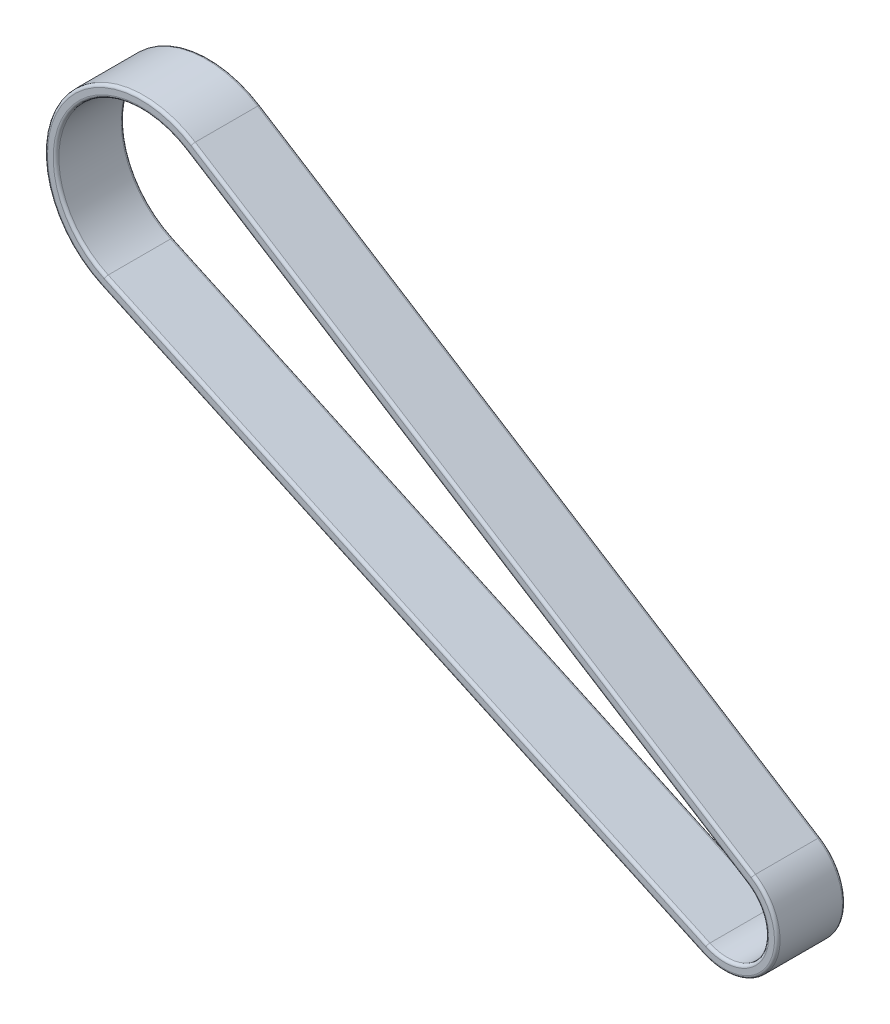
ISO-10303-21;
HEADER;
FILE_DESCRIPTION(('STEP AP214'),'2;1');
FILE_NAME('part.step','',(''),(''),'','','');
FILE_SCHEMA(('AUTOMOTIVE_DESIGN { 1 0 10303 214 1 1 1 1 }'));
ENDSEC;
DATA;
#1=APPLICATION_CONTEXT('core data for automotive mechanical design processes');
#2=APPLICATION_PROTOCOL_DEFINITION('international standard','automotive_design',2000,#1);
#3=PRODUCT_CONTEXT('',#1,'mechanical');
#4=PRODUCT('Part','Part','',(#3));
#5=PRODUCT_RELATED_PRODUCT_CATEGORY('part','',(#4));
#6=PRODUCT_DEFINITION_FORMATION('','',#4);
#7=PRODUCT_DEFINITION_CONTEXT('part definition',#1,'design');
#8=PRODUCT_DEFINITION('design','',#6,#7);
#9=PRODUCT_DEFINITION_SHAPE('','',#8);
#10=(LENGTH_UNIT() NAMED_UNIT(*) SI_UNIT(.MILLI.,.METRE.));
#11=(NAMED_UNIT(*) PLANE_ANGLE_UNIT() SI_UNIT($,.RADIAN.));
#12=(NAMED_UNIT(*) SI_UNIT($,.STERADIAN.) SOLID_ANGLE_UNIT());
#13=UNCERTAINTY_MEASURE_WITH_UNIT(LENGTH_MEASURE(1.E-05),#10,'distance_accuracy_value','');
#14=(GEOMETRIC_REPRESENTATION_CONTEXT(3) GLOBAL_UNCERTAINTY_ASSIGNED_CONTEXT((#13)) GLOBAL_UNIT_ASSIGNED_CONTEXT((#10,
#11,#12)) REPRESENTATION_CONTEXT('',''));
#15=CARTESIAN_POINT('',(0.,0.,0.));
#16=DIRECTION('',(0.,0.,1.));
#17=DIRECTION('',(1.,0.,0.));
#18=AXIS2_PLACEMENT_3D('',#15,#16,#17);
#19=CARTESIAN_POINT('',(-3.06760585061165,-6.64608858526256,-5.));
#20=DIRECTION('',(0.,0.,-1.));
#21=DIRECTION('',(-0.907950009688735,0.419078488956694,0.));
#22=AXIS2_PLACEMENT_3D('',#19,#20,#21);
#23=PLANE('',#22);
#24=CARTESIAN_POINT('',(1.38777878078145E-13,0.,-5.));
#25=DIRECTION('',(0.,0.,-1.));
#26=DIRECTION('',(-1.,0.,0.));
#27=AXIS2_PLACEMENT_3D('',#24,#25,#26);
#28=CIRCLE('',#27,8.81988381997051);
#29=CARTESIAN_POINT('',(4.71142714031744,7.4560582682313,-5.));
#30=VERTEX_POINT('',#29);
#31=CARTESIAN_POINT('',(-3.6962235840467,-8.00801359979566,-5.));
#32=VERTEX_POINT('',#31);
#33=EDGE_CURVE('E192',#30,#32,#28,.T.);
#34=ORIENTED_EDGE('',*,*,#33,.T.);
#35=DIRECTION('',(-0.907950009688735,0.419078488956694,0.));
#36=VECTOR('',#35,1.);
#37=CARTESIAN_POINT('',(-109.914795067786,41.0188248401359,-5.));
#38=LINE('',#37,#36);
#39=CARTESIAN_POINT('',(-109.914795067786,41.0188248401359,-5.));
#40=VERTEX_POINT('',#39);
#41=EDGE_CURVE('E194',#32,#40,#38,.T.);
#42=ORIENTED_EDGE('',*,*,#41,.T.);
#43=CARTESIAN_POINT('',(-103.,56.,-5.));
#44=DIRECTION('',(0.,0.,-1.));
#45=DIRECTION('',(-1.,0.,0.));
#46=AXIS2_PLACEMENT_3D('',#43,#44,#45);
#47=CIRCLE('',#46,16.5);
#48=CARTESIAN_POINT('',(-94.1859895887503,69.9485920605048,-5.));
#49=VERTEX_POINT('',#48);
#50=EDGE_CURVE('E188',#40,#49,#47,.T.);
#51=ORIENTED_EDGE('',*,*,#50,.T.);
#52=DIRECTION('',(0.845369215788168,-0.534182449166666,0.));
#53=VECTOR('',#52,1.);
#54=CARTESIAN_POINT('',(4.71142714031744,7.4560582682313,-5.));
#55=LINE('',#54,#53);
#56=EDGE_CURVE('E190',#49,#30,#55,.T.);
#57=ORIENTED_EDGE('',*,*,#56,.T.);
#58=EDGE_LOOP('',(#34,#42,#51,#57));
#59=FACE_BOUND('',#58,.T.);
#60=DIRECTION('',(0.845369215788168,-0.534182449166666,0.));
#61=VECTOR('',#60,1.);
#62=CARTESIAN_POINT('',(4.98623287259965,6.09949550524219,-5.));
#63=LINE('',#62,#61);
#64=CARTESIAN_POINT('',(4.17724469115077,6.61068905244314,-5.));
#65=VERTEX_POINT('',#64);
#66=CARTESIAN_POINT('',(-94.720172037917,69.1032228447166,-5.));
#67=VERTEX_POINT('',#66);
#68=EDGE_CURVE('E155',#65,#67,#63,.F.);
#69=ORIENTED_EDGE('',*,*,#68,.T.);
#70=CARTESIAN_POINT('',(-103.,56.,-5.));
#71=DIRECTION('',(0.,0.,-1.));
#72=DIRECTION('',(-1.,0.,0.));
#73=AXIS2_PLACEMENT_3D('',#70,#71,#72);
#74=CIRCLE('',#73,15.5);
#75=CARTESIAN_POINT('',(-109.495716578829,41.9267748498246,-5.));
#76=VERTEX_POINT('',#75);
#77=EDGE_CURVE('E186',#67,#76,#74,.F.);
#78=ORIENTED_EDGE('',*,*,#77,.T.);
#79=DIRECTION('',(-0.907950009688735,0.419078488956694,0.));
#80=VECTOR('',#79,1.);
#81=CARTESIAN_POINT('',(-3.27714509509,-7.10006359010692,-5.));
#82=LINE('',#81,#80);
#83=CARTESIAN_POINT('',(-3.27714509509,-7.10006359010692,-5.));
#84=VERTEX_POINT('',#83);
#85=EDGE_CURVE('E158',#76,#84,#82,.F.);
#86=ORIENTED_EDGE('',*,*,#85,.T.);
#87=CARTESIAN_POINT('',(1.38777878078145E-13,0.,-5.));
#88=DIRECTION('',(0.,0.,-1.));
#89=DIRECTION('',(-1.,0.,0.));
#90=AXIS2_PLACEMENT_3D('',#87,#88,#89);
#91=CIRCLE('',#90,7.81988381997051);
#92=EDGE_CURVE('E151',#84,#65,#91,.F.);
#93=ORIENTED_EDGE('',*,*,#92,.T.);
#94=EDGE_LOOP('',(#69,#78,#86,#93));
#95=FACE_BOUND('',#94,.T.);
#96=ADVANCED_FACE('F39',(#59,#95),#23,.T.);
#97=CARTESIAN_POINT('',(-94.9872632625003,68.6805382368225,7.));
#98=DIRECTION('',(0.,0.,-1.));
#99=DIRECTION('',(0.845369215788168,-0.534182449166666,0.));
#100=AXIS2_PLACEMENT_3D('',#97,#98,#99);
#101=PLANE('',#100);
#102=DIRECTION('',(-0.907950009688735,0.419078488956694,0.));
#103=VECTOR('',#102,1.);
#104=CARTESIAN_POINT('',(-3.69622358404669,-8.00801359979566,7.));
#105=LINE('',#104,#103);
#106=CARTESIAN_POINT('',(-109.914795067786,41.0188248401359,7.));
#107=VERTEX_POINT('',#106);
#108=CARTESIAN_POINT('',(-3.6962235840467,-8.00801359979566,7.));
#109=VERTEX_POINT('',#108);
#110=EDGE_CURVE('E48',#107,#109,#105,.F.);
#111=ORIENTED_EDGE('',*,*,#110,.T.);
#112=CARTESIAN_POINT('',(1.38777878078145E-13,0.,7.));
#113=DIRECTION('',(0.,0.,-1.));
#114=DIRECTION('',(-1.,0.,0.));
#115=AXIS2_PLACEMENT_3D('',#112,#113,#114);
#116=CIRCLE('',#115,8.81988381997051);
#117=CARTESIAN_POINT('',(4.71142714031744,7.4560582682313,7.));
#118=VERTEX_POINT('',#117);
#119=EDGE_CURVE('E11',#109,#118,#116,.F.);
#120=ORIENTED_EDGE('',*,*,#119,.T.);
#121=DIRECTION('',(0.845369215788168,-0.534182449166666,0.));
#122=VECTOR('',#121,1.);
#123=CARTESIAN_POINT('',(-94.1859895887503,69.9485920605048,7.));
#124=LINE('',#123,#122);
#125=CARTESIAN_POINT('',(-94.1859895887503,69.9485920605048,7.));
#126=VERTEX_POINT('',#125);
#127=EDGE_CURVE('E241',#118,#126,#124,.F.);
#128=ORIENTED_EDGE('',*,*,#127,.T.);
#129=CARTESIAN_POINT('',(-103.,56.,7.));
#130=DIRECTION('',(0.,0.,-1.));
#131=DIRECTION('',(-1.,0.,0.));
#132=AXIS2_PLACEMENT_3D('',#129,#130,#131);
#133=CIRCLE('',#132,16.5);
#134=EDGE_CURVE('E59',#126,#107,#133,.F.);
#135=ORIENTED_EDGE('',*,*,#134,.T.);
#136=EDGE_LOOP('',(#111,#120,#128,#135));
#137=FACE_BOUND('',#136,.T.);
#138=DIRECTION('',(-0.907950009688735,0.419078488956694,0.));
#139=VECTOR('',#138,1.);
#140=CARTESIAN_POINT('',(-107.715205186748,41.1049520448231,7.));
#141=LINE('',#140,#139);
#142=CARTESIAN_POINT('',(-3.27714509509,-7.10006359010693,7.));
#143=VERTEX_POINT('',#142);
#144=CARTESIAN_POINT('',(-109.495716578829,41.9267748498246,7.));
#145=VERTEX_POINT('',#144);
#146=EDGE_CURVE('E236',#143,#145,#141,.T.);
#147=ORIENTED_EDGE('',*,*,#146,.T.);
#148=CARTESIAN_POINT('',(-103.,56.,7.));
#149=DIRECTION('',(0.,0.,-1.));
#150=DIRECTION('',(-1.,0.,0.));
#151=AXIS2_PLACEMENT_3D('',#148,#149,#150);
#152=CIRCLE('',#151,15.5);
#153=CARTESIAN_POINT('',(-94.720172037917,69.1032228447166,7.));
#154=VERTEX_POINT('',#153);
#155=EDGE_CURVE('E238',#145,#154,#152,.T.);
#156=ORIENTED_EDGE('',*,*,#155,.T.);
#157=DIRECTION('',(0.845369215788168,-0.534182449166666,0.));
#158=VECTOR('',#157,1.);
#159=CARTESIAN_POINT('',(-94.720172037917,69.1032228447166,7.));
#160=LINE('',#159,#158);
#161=CARTESIAN_POINT('',(4.17724469115077,6.61068905244314,7.));
#162=VERTEX_POINT('',#161);
#163=EDGE_CURVE('E232',#154,#162,#160,.T.);
#164=ORIENTED_EDGE('',*,*,#163,.T.);
#165=CARTESIAN_POINT('',(1.38777878078145E-13,0.,7.));
#166=DIRECTION('',(0.,0.,-1.));
#167=DIRECTION('',(-1.,0.,0.));
#168=AXIS2_PLACEMENT_3D('',#165,#166,#167);
#169=CIRCLE('',#168,7.81988381997051);
#170=EDGE_CURVE('E234',#162,#143,#169,.T.);
#171=ORIENTED_EDGE('',*,*,#170,.T.);
#172=EDGE_LOOP('',(#147,#156,#164,#171));
#173=FACE_BOUND('',#172,.T.);
#174=ADVANCED_FACE('F332',(#137,#173),#101,.F.);
#175=CARTESIAN_POINT('',(1.38777878078145E-13,0.,0.));
#176=DIRECTION('',(0.,0.,1.));
#177=DIRECTION('',(1.,0.,0.));
#178=AXIS2_PLACEMENT_3D('',#175,#176,#177);
#179=CYLINDRICAL_SURFACE('',#178,7.31988381997051);
#180=DIRECTION('',(0.,0.,1.));
#181=VECTOR('',#180,1.);
#182=CARTESIAN_POINT('',(3.91015346656744,6.18800444454905,0.));
#183=LINE('',#182,#181);
#184=CARTESIAN_POINT('',(3.91015346656744,6.18800444454905,-4.5));
#185=VERTEX_POINT('',#184);
#186=CARTESIAN_POINT('',(3.91015346656744,6.18800444454905,6.5));
#187=VERTEX_POINT('',#186);
#188=EDGE_CURVE('E291',#185,#187,#183,.T.);
#189=ORIENTED_EDGE('',*,*,#188,.F.);
#190=CARTESIAN_POINT('',(1.38777878078145E-13,0.,-4.5));
#191=DIRECTION('',(0.,0.,-1.));
#192=DIRECTION('',(-1.,0.,0.));
#193=AXIS2_PLACEMENT_3D('',#190,#191,#192);
#194=CIRCLE('',#193,7.31988381997051);
#195=CARTESIAN_POINT('',(-3.06760585061165,-6.64608858526256,-4.5));
#196=VERTEX_POINT('',#195);
#197=EDGE_CURVE('E167',#185,#196,#194,.T.);
#198=ORIENTED_EDGE('',*,*,#197,.T.);
#199=DIRECTION('',(0.,0.,1.));
#200=VECTOR('',#199,1.);
#201=CARTESIAN_POINT('',(-3.06760585061165,-6.64608858526256,0.));
#202=LINE('',#201,#200);
#203=CARTESIAN_POINT('',(-3.06760585061165,-6.64608858526256,6.5));
#204=VERTEX_POINT('',#203);
#205=EDGE_CURVE('E176',#196,#204,#202,.T.);
#206=ORIENTED_EDGE('',*,*,#205,.T.);
#207=CARTESIAN_POINT('',(1.38777878078145E-13,0.,6.5));
#208=DIRECTION('',(0.,0.,-1.));
#209=DIRECTION('',(-1.,0.,0.));
#210=AXIS2_PLACEMENT_3D('',#207,#208,#209);
#211=CIRCLE('',#210,7.31988381997051);
#212=EDGE_CURVE('E221',#204,#187,#211,.F.);
#213=ORIENTED_EDGE('',*,*,#212,.T.);
#214=EDGE_LOOP('',(#189,#198,#206,#213));
#215=FACE_BOUND('',#214,.T.);
#216=ADVANCED_FACE('F290',(#215),#179,.F.);
#217=CARTESIAN_POINT('',(-3.06760585061165,-6.64608858526256,0.));
#218=DIRECTION('',(0.419078488956694,0.907950009688735,0.));
#219=DIRECTION('',(-0.907950009688735,0.419078488956694,0.));
#220=AXIS2_PLACEMENT_3D('',#217,#218,#219);
#221=PLANE('',#220);
#222=ORIENTED_EDGE('',*,*,#205,.F.);
#223=DIRECTION('',(-0.907950009688735,0.419078488956694,0.));
#224=VECTOR('',#223,1.);
#225=CARTESIAN_POINT('',(-3.06760585061165,-6.64608858526256,-4.5));
#226=LINE('',#225,#224);
#227=CARTESIAN_POINT('',(-109.286177334351,42.380749854669,-4.5));
#228=VERTEX_POINT('',#227);
#229=EDGE_CURVE('E219',#196,#228,#226,.T.);
#230=ORIENTED_EDGE('',*,*,#229,.T.);
#231=DIRECTION('',(0.,0.,1.));
#232=VECTOR('',#231,1.);
#233=CARTESIAN_POINT('',(-109.286177334351,42.380749854669,0.));
#234=LINE('',#233,#232);
#235=CARTESIAN_POINT('',(-109.286177334351,42.380749854669,6.5));
#236=VERTEX_POINT('',#235);
#237=EDGE_CURVE('E179',#228,#236,#234,.T.);
#238=ORIENTED_EDGE('',*,*,#237,.T.);
#239=DIRECTION('',(0.907950009688735,-0.419078488956694,0.));
#240=VECTOR('',#239,1.);
#241=CARTESIAN_POINT('',(-3.06760585061165,-6.64608858526256,6.5));
#242=LINE('',#241,#240);
#243=EDGE_CURVE('E217',#236,#204,#242,.T.);
#244=ORIENTED_EDGE('',*,*,#243,.T.);
#245=EDGE_LOOP('',(#222,#230,#238,#244));
#246=FACE_BOUND('',#245,.T.);
#247=ADVANCED_FACE('F543',(#246),#221,.T.);
#248=CARTESIAN_POINT('',(-103.,56.,0.));
#249=DIRECTION('',(0.,0.,1.));
#250=DIRECTION('',(1.,0.,0.));
#251=AXIS2_PLACEMENT_3D('',#248,#249,#250);
#252=CYLINDRICAL_SURFACE('',#251,15.);
#253=ORIENTED_EDGE('',*,*,#237,.F.);
#254=CARTESIAN_POINT('',(-103.,56.,-4.5));
#255=DIRECTION('',(0.,0.,-1.));
#256=DIRECTION('',(-1.,0.,0.));
#257=AXIS2_PLACEMENT_3D('',#254,#255,#256);
#258=CIRCLE('',#257,15.);
#259=CARTESIAN_POINT('',(-94.9872632625003,68.6805382368225,-4.5));
#260=VERTEX_POINT('',#259);
#261=EDGE_CURVE('E214',#228,#260,#258,.T.);
#262=ORIENTED_EDGE('',*,*,#261,.T.);
#263=DIRECTION('',(0.,0.,1.));
#264=VECTOR('',#263,1.);
#265=CARTESIAN_POINT('',(-94.9872632625003,68.6805382368225,0.));
#266=LINE('',#265,#264);
#267=CARTESIAN_POINT('',(-94.9872632625003,68.6805382368225,6.5));
#268=VERTEX_POINT('',#267);
#269=EDGE_CURVE('E297',#260,#268,#266,.T.);
#270=ORIENTED_EDGE('',*,*,#269,.T.);
#271=CARTESIAN_POINT('',(-103.,56.,6.5));
#272=DIRECTION('',(0.,0.,-1.));
#273=DIRECTION('',(-1.,0.,0.));
#274=AXIS2_PLACEMENT_3D('',#271,#272,#273);
#275=CIRCLE('',#274,15.);
#276=EDGE_CURVE('E211',#268,#236,#275,.F.);
#277=ORIENTED_EDGE('',*,*,#276,.T.);
#278=EDGE_LOOP('',(#253,#262,#270,#277));
#279=FACE_BOUND('',#278,.T.);
#280=ADVANCED_FACE('F535',(#279),#252,.F.);
#281=CARTESIAN_POINT('',(-94.9872632625003,68.6805382368225,0.));
#282=DIRECTION('',(-0.534182449166666,-0.845369215788168,0.));
#283=DIRECTION('',(0.845369215788168,-0.534182449166666,0.));
#284=AXIS2_PLACEMENT_3D('',#281,#282,#283);
#285=PLANE('',#284);
#286=ORIENTED_EDGE('',*,*,#269,.F.);
#287=DIRECTION('',(0.845369215788168,-0.534182449166666,0.));
#288=VECTOR('',#287,1.);
#289=CARTESIAN_POINT('',(-94.9872632625003,68.6805382368225,-4.5));
#290=LINE('',#289,#288);
#291=EDGE_CURVE('E230',#260,#185,#290,.T.);
#292=ORIENTED_EDGE('',*,*,#291,.T.);
#293=ORIENTED_EDGE('',*,*,#188,.T.);
#294=DIRECTION('',(-0.845369215788168,0.534182449166666,0.));
#295=VECTOR('',#294,1.);
#296=CARTESIAN_POINT('',(-94.9872632625003,68.6805382368225,6.5));
#297=LINE('',#296,#295);
#298=EDGE_CURVE('E228',#187,#268,#297,.T.);
#299=ORIENTED_EDGE('',*,*,#298,.T.);
#300=EDGE_LOOP('',(#286,#292,#293,#299));
#301=FACE_BOUND('',#300,.T.);
#302=ADVANCED_FACE('F295',(#301),#285,.T.);
#303=CARTESIAN_POINT('',(1.38777878078145E-13,0.,0.));
#304=DIRECTION('',(0.,0.,1.));
#305=DIRECTION('',(1.,0.,0.));
#306=AXIS2_PLACEMENT_3D('',#303,#304,#305);
#307=CYLINDRICAL_SURFACE('',#306,9.31988381997051);
#308=DIRECTION('',(0.,0.,1.));
#309=VECTOR('',#308,1.);
#310=CARTESIAN_POINT('',(-3.90576282852504,-8.46198860464003,0.));
#311=LINE('',#310,#309);
#312=CARTESIAN_POINT('',(-3.90576282852504,-8.46198860464003,-4.5));
#313=VERTEX_POINT('',#312);
#314=CARTESIAN_POINT('',(-3.90576282852504,-8.46198860464003,6.5));
#315=VERTEX_POINT('',#314);
#316=EDGE_CURVE('E301',#313,#315,#311,.T.);
#317=ORIENTED_EDGE('',*,*,#316,.F.);
#318=CARTESIAN_POINT('',(1.38777878078145E-13,0.,-4.5));
#319=DIRECTION('',(0.,0.,-1.));
#320=DIRECTION('',(-1.,0.,0.));
#321=AXIS2_PLACEMENT_3D('',#318,#319,#320);
#322=CIRCLE('',#321,9.31988381997051);
#323=CARTESIAN_POINT('',(4.97851836490078,7.87874287612539,-4.5));
#324=VERTEX_POINT('',#323);
#325=EDGE_CURVE('E205',#313,#324,#322,.F.);
#326=ORIENTED_EDGE('',*,*,#325,.T.);
#327=DIRECTION('',(0.,0.,1.));
#328=VECTOR('',#327,1.);
#329=CARTESIAN_POINT('',(4.97851836490078,7.87874287612539,0.));
#330=LINE('',#329,#328);
#331=CARTESIAN_POINT('',(4.97851836490078,7.87874287612539,6.5));
#332=VERTEX_POINT('',#331);
#333=EDGE_CURVE('E304',#324,#332,#330,.T.);
#334=ORIENTED_EDGE('',*,*,#333,.T.);
#335=CARTESIAN_POINT('',(1.38777878078145E-13,0.,6.5));
#336=DIRECTION('',(0.,0.,-1.));
#337=DIRECTION('',(-1.,0.,0.));
#338=AXIS2_PLACEMENT_3D('',#335,#336,#337);
#339=CIRCLE('',#338,9.31988381997051);
#340=EDGE_CURVE('E202',#332,#315,#339,.T.);
#341=ORIENTED_EDGE('',*,*,#340,.T.);
#342=EDGE_LOOP('',(#317,#326,#334,#341));
#343=FACE_BOUND('',#342,.T.);
#344=ADVANCED_FACE('F342',(#343),#307,.T.);
#345=CARTESIAN_POINT('',(-3.90576282852504,-8.46198860464003,0.));
#346=DIRECTION('',(0.419078488956694,0.907950009688735,0.));
#347=DIRECTION('',(-0.907950009688735,0.419078488956694,0.));
#348=AXIS2_PLACEMENT_3D('',#345,#346,#347);
#349=PLANE('',#348);
#350=DIRECTION('',(0.,0.,1.));
#351=VECTOR('',#350,1.);
#352=CARTESIAN_POINT('',(-110.124334312264,40.5648498352915,0.));
#353=LINE('',#352,#351);
#354=CARTESIAN_POINT('',(-110.124334312264,40.5648498352915,-4.5));
#355=VERTEX_POINT('',#354);
#356=CARTESIAN_POINT('',(-110.124334312264,40.5648498352915,6.5));
#357=VERTEX_POINT('',#356);
#358=EDGE_CURVE('E307',#355,#357,#353,.T.);
#359=ORIENTED_EDGE('',*,*,#358,.F.);
#360=DIRECTION('',(-0.907950009688735,0.419078488956694,0.));
#361=VECTOR('',#360,1.);
#362=CARTESIAN_POINT('',(-3.90576282852504,-8.46198860464003,-4.5));
#363=LINE('',#362,#361);
#364=EDGE_CURVE('E199',#355,#313,#363,.F.);
#365=ORIENTED_EDGE('',*,*,#364,.T.);
#366=ORIENTED_EDGE('',*,*,#316,.T.);
#367=DIRECTION('',(0.907950009688735,-0.419078488956694,0.));
#368=VECTOR('',#367,1.);
#369=CARTESIAN_POINT('',(-110.124334312264,40.5648498352915,6.5));
#370=LINE('',#369,#368);
#371=EDGE_CURVE('E197',#315,#357,#370,.F.);
#372=ORIENTED_EDGE('',*,*,#371,.T.);
#373=EDGE_LOOP('',(#359,#365,#366,#372));
#374=FACE_BOUND('',#373,.T.);
#375=ADVANCED_FACE('F350',(#374),#349,.F.);
#376=CARTESIAN_POINT('',(-103.,56.,0.));
#377=DIRECTION('',(0.,0.,1.));
#378=DIRECTION('',(1.,0.,0.));
#379=AXIS2_PLACEMENT_3D('',#376,#377,#378);
#380=CYLINDRICAL_SURFACE('',#379,17.);
#381=DIRECTION('',(0.,0.,1.));
#382=VECTOR('',#381,1.);
#383=CARTESIAN_POINT('',(-93.918898364167,70.3712766683989,0.));
#384=LINE('',#383,#382);
#385=CARTESIAN_POINT('',(-93.918898364167,70.3712766683989,-4.5));
#386=VERTEX_POINT('',#385);
#387=CARTESIAN_POINT('',(-93.918898364167,70.3712766683989,6.5));
#388=VERTEX_POINT('',#387);
#389=EDGE_CURVE('E182',#386,#388,#384,.T.);
#390=ORIENTED_EDGE('',*,*,#389,.F.);
#391=CARTESIAN_POINT('',(-103.,56.,-4.5));
#392=DIRECTION('',(0.,0.,-1.));
#393=DIRECTION('',(-1.,0.,0.));
#394=AXIS2_PLACEMENT_3D('',#391,#392,#393);
#395=CIRCLE('',#394,17.);
#396=EDGE_CURVE('E226',#386,#355,#395,.F.);
#397=ORIENTED_EDGE('',*,*,#396,.T.);
#398=ORIENTED_EDGE('',*,*,#358,.T.);
#399=CARTESIAN_POINT('',(-103.,56.,6.5));
#400=DIRECTION('',(0.,0.,-1.));
#401=DIRECTION('',(-1.,0.,0.));
#402=AXIS2_PLACEMENT_3D('',#399,#400,#401);
#403=CIRCLE('',#402,17.);
#404=EDGE_CURVE('E224',#357,#388,#403,.T.);
#405=ORIENTED_EDGE('',*,*,#404,.T.);
#406=EDGE_LOOP('',(#390,#397,#398,#405));
#407=FACE_BOUND('',#406,.T.);
#408=ADVANCED_FACE('F314',(#407),#380,.T.);
#409=CARTESIAN_POINT('',(-93.918898364167,70.3712766683989,0.));
#410=DIRECTION('',(-0.534182449166666,-0.845369215788168,0.));
#411=DIRECTION('',(0.845369215788168,-0.534182449166666,0.));
#412=AXIS2_PLACEMENT_3D('',#409,#410,#411);
#413=PLANE('',#412);
#414=ORIENTED_EDGE('',*,*,#333,.F.);
#415=DIRECTION('',(0.845369215788168,-0.534182449166666,0.));
#416=VECTOR('',#415,1.);
#417=CARTESIAN_POINT('',(-93.918898364167,70.3712766683989,-4.5));
#418=LINE('',#417,#416);
#419=EDGE_CURVE('E209',#324,#386,#418,.F.);
#420=ORIENTED_EDGE('',*,*,#419,.T.);
#421=ORIENTED_EDGE('',*,*,#389,.T.);
#422=DIRECTION('',(-0.845369215788168,0.534182449166666,0.));
#423=VECTOR('',#422,1.);
#424=CARTESIAN_POINT('',(4.97851836490078,7.87874287612539,6.5));
#425=LINE('',#424,#423);
#426=EDGE_CURVE('E207',#388,#332,#425,.F.);
#427=ORIENTED_EDGE('',*,*,#426,.T.);
#428=EDGE_LOOP('',(#414,#420,#421,#427));
#429=FACE_BOUND('',#428,.T.);
#430=ADVANCED_FACE('F338',(#429),#413,.F.);
#431=CARTESIAN_POINT('',(5.52041532176631,6.94486472103034,-4.5));
#432=DIRECTION('',(-0.845369215788168,0.534182449166666,0.));
#433=DIRECTION('',(-0.534182449166666,-0.845369215788168,0.));
#434=AXIS2_PLACEMENT_3D('',#431,#432,#433);
#435=CYLINDRICAL_SURFACE('',#434,0.5);
#436=CARTESIAN_POINT('',(-94.1859895887503,69.9485920605048,-4.5));
#437=DIRECTION('',(-0.845369215788169,0.534182449166665,0.));
#438=DIRECTION('',(-0.534182449166665,-0.845369215788169,0.));
#439=AXIS2_PLACEMENT_3D('',#436,#437,#438);
#440=CIRCLE('',#439,0.5);
#441=EDGE_CURVE('E249',#386,#49,#440,.T.);
#442=ORIENTED_EDGE('',*,*,#441,.F.);
#443=ORIENTED_EDGE('',*,*,#419,.F.);
#444=CARTESIAN_POINT('',(4.71142714031744,7.4560582682313,-4.5));
#445=DIRECTION('',(0.845369215788167,-0.534182449166668,0.));
#446=DIRECTION('',(0.534182449166668,0.845369215788167,0.));
#447=AXIS2_PLACEMENT_3D('',#444,#445,#446);
#448=CIRCLE('',#447,0.5);
#449=EDGE_CURVE('E252',#30,#324,#448,.T.);
#450=ORIENTED_EDGE('',*,*,#449,.F.);
#451=ORIENTED_EDGE('',*,*,#56,.F.);
#452=EDGE_LOOP('',(#442,#443,#450,#451));
#453=FACE_BOUND('',#452,.T.);
#454=ADVANCED_FACE('F361',(#453),#435,.T.);
#455=CARTESIAN_POINT('',(1.38777878078145E-13,0.,-4.5));
#456=DIRECTION('',(0.,0.,-1.));
#457=DIRECTION('',(-1.,0.,0.));
#458=AXIS2_PLACEMENT_3D('',#455,#456,#457);
#459=TOROIDAL_SURFACE('',#458,8.81988381997051,0.5);
#460=ORIENTED_EDGE('',*,*,#449,.T.);
#461=ORIENTED_EDGE('',*,*,#325,.F.);
#462=CARTESIAN_POINT('',(-3.6962235840467,-8.00801359979566,-4.5));
#463=DIRECTION('',(-0.907950009688735,0.419078488956694,0.));
#464=DIRECTION('',(-0.419078488956694,-0.907950009688735,0.));
#465=AXIS2_PLACEMENT_3D('',#462,#463,#464);
#466=CIRCLE('',#465,0.5);
#467=EDGE_CURVE('E247',#32,#313,#466,.T.);
#468=ORIENTED_EDGE('',*,*,#467,.F.);
#469=ORIENTED_EDGE('',*,*,#33,.F.);
#470=EDGE_LOOP('',(#460,#461,#468,#469));
#471=FACE_BOUND('',#470,.T.);
#472=ADVANCED_FACE('F346',(#471),#459,.T.);
#473=CARTESIAN_POINT('',(-103.,56.,-4.5));
#474=DIRECTION('',(0.,0.,-1.));
#475=DIRECTION('',(-1.,0.,0.));
#476=AXIS2_PLACEMENT_3D('',#473,#474,#475);
#477=TOROIDAL_SURFACE('',#476,16.5,0.5);
#478=ORIENTED_EDGE('',*,*,#441,.T.);
#479=ORIENTED_EDGE('',*,*,#50,.F.);
#480=CARTESIAN_POINT('',(-109.914795067786,41.0188248401359,-4.5));
#481=DIRECTION('',(0.907950009688735,-0.419078488956695,0.));
#482=DIRECTION('',(0.419078488956695,0.907950009688735,0.));
#483=AXIS2_PLACEMENT_3D('',#480,#481,#482);
#484=CIRCLE('',#483,0.5);
#485=EDGE_CURVE('E245',#355,#40,#484,.T.);
#486=ORIENTED_EDGE('',*,*,#485,.F.);
#487=ORIENTED_EDGE('',*,*,#396,.F.);
#488=EDGE_LOOP('',(#478,#479,#486,#487));
#489=FACE_BOUND('',#488,.T.);
#490=ADVANCED_FACE('F356',(#489),#477,.T.);
#491=CARTESIAN_POINT('',(-3.69622358404669,-8.00801359979566,-4.5));
#492=DIRECTION('',(0.907950009688735,-0.419078488956694,0.));
#493=DIRECTION('',(0.419078488956694,0.907950009688735,0.));
#494=AXIS2_PLACEMENT_3D('',#491,#492,#493);
#495=CYLINDRICAL_SURFACE('',#494,0.5);
#496=ORIENTED_EDGE('',*,*,#467,.T.);
#497=ORIENTED_EDGE('',*,*,#364,.F.);
#498=ORIENTED_EDGE('',*,*,#485,.T.);
#499=ORIENTED_EDGE('',*,*,#41,.F.);
#500=EDGE_LOOP('',(#496,#497,#498,#499));
#501=FACE_BOUND('',#500,.T.);
#502=ADVANCED_FACE('F353',(#501),#495,.T.);
#503=CARTESIAN_POINT('',(1.38777878078145E-13,0.,-4.5));
#504=DIRECTION('',(0.,0.,-1.));
#505=DIRECTION('',(-1.,0.,0.));
#506=AXIS2_PLACEMENT_3D('',#503,#504,#505);
#507=TOROIDAL_SURFACE('',#506,7.81988381997051,0.5);
#508=CARTESIAN_POINT('',(4.17724469115077,6.61068905244314,-4.5));
#509=DIRECTION('',(-0.845369215788167,0.534182449166667,0.));
#510=DIRECTION('',(-0.534182449166667,-0.845369215788168,0.));
#511=AXIS2_PLACEMENT_3D('',#508,#509,#510);
#512=CIRCLE('',#511,0.5);
#513=EDGE_CURVE('E165',#65,#185,#512,.T.);
#514=ORIENTED_EDGE('',*,*,#513,.F.);
#515=ORIENTED_EDGE('',*,*,#92,.F.);
#516=CARTESIAN_POINT('',(-3.27714509509,-7.10006359010692,-4.5));
#517=DIRECTION('',(-0.907950009688735,0.419078488956694,0.));
#518=DIRECTION('',(-0.419078488956694,-0.907950009688735,0.));
#519=AXIS2_PLACEMENT_3D('',#516,#517,#518);
#520=CIRCLE('',#519,0.5);
#521=EDGE_CURVE('E170',#196,#84,#520,.T.);
#522=ORIENTED_EDGE('',*,*,#521,.F.);
#523=ORIENTED_EDGE('',*,*,#197,.F.);
#524=EDGE_LOOP('',(#514,#515,#522,#523));
#525=FACE_BOUND('',#524,.T.);
#526=ADVANCED_FACE('F166',(#525),#507,.T.);
#527=CARTESIAN_POINT('',(-3.27714509509,-7.10006359010692,-4.5));
#528=DIRECTION('',(-0.907950009688735,0.419078488956694,0.));
#529=DIRECTION('',(-0.419078488956694,-0.907950009688735,0.));
#530=AXIS2_PLACEMENT_3D('',#527,#528,#529);
#531=CYLINDRICAL_SURFACE('',#530,0.5);
#532=ORIENTED_EDGE('',*,*,#521,.T.);
#533=ORIENTED_EDGE('',*,*,#85,.F.);
#534=CARTESIAN_POINT('',(-109.495716578829,41.9267748498246,-4.5));
#535=DIRECTION('',(-0.907950009688735,0.419078488956695,0.));
#536=DIRECTION('',(-0.419078488956695,-0.907950009688735,0.));
#537=AXIS2_PLACEMENT_3D('',#534,#535,#536);
#538=CIRCLE('',#537,0.5);
#539=EDGE_CURVE('E171',#228,#76,#538,.T.);
#540=ORIENTED_EDGE('',*,*,#539,.F.);
#541=ORIENTED_EDGE('',*,*,#229,.F.);
#542=EDGE_LOOP('',(#532,#533,#540,#541));
#543=FACE_BOUND('',#542,.T.);
#544=ADVANCED_FACE('F395',(#543),#531,.T.);
#545=CARTESIAN_POINT('',(-94.720172037917,69.1032228447166,-4.5));
#546=DIRECTION('',(0.845369215788168,-0.534182449166666,0.));
#547=DIRECTION('',(0.534182449166666,0.845369215788168,0.));
#548=AXIS2_PLACEMENT_3D('',#545,#546,#547);
#549=CYLINDRICAL_SURFACE('',#548,0.5);
#550=ORIENTED_EDGE('',*,*,#513,.T.);
#551=ORIENTED_EDGE('',*,*,#291,.F.);
#552=CARTESIAN_POINT('',(-94.720172037917,69.1032228447166,-4.5));
#553=DIRECTION('',(-0.845369215788169,0.534182449166665,0.));
#554=DIRECTION('',(-0.534182449166665,-0.845369215788169,0.));
#555=AXIS2_PLACEMENT_3D('',#552,#553,#554);
#556=CIRCLE('',#555,0.5);
#557=EDGE_CURVE('E175',#67,#260,#556,.T.);
#558=ORIENTED_EDGE('',*,*,#557,.F.);
#559=ORIENTED_EDGE('',*,*,#68,.F.);
#560=EDGE_LOOP('',(#550,#551,#558,#559));
#561=FACE_BOUND('',#560,.T.);
#562=ADVANCED_FACE('F174',(#561),#549,.T.);
#563=CARTESIAN_POINT('',(-103.,56.,-4.5));
#564=DIRECTION('',(0.,0.,-1.));
#565=DIRECTION('',(-1.,0.,0.));
#566=AXIS2_PLACEMENT_3D('',#563,#564,#565);
#567=TOROIDAL_SURFACE('',#566,15.5,0.5);
#568=ORIENTED_EDGE('',*,*,#539,.T.);
#569=ORIENTED_EDGE('',*,*,#77,.F.);
#570=ORIENTED_EDGE('',*,*,#557,.T.);
#571=ORIENTED_EDGE('',*,*,#261,.F.);
#572=EDGE_LOOP('',(#568,#569,#570,#571));
#573=FACE_BOUND('',#572,.T.);
#574=ADVANCED_FACE('F409',(#573),#567,.T.);
#575=CARTESIAN_POINT('',(-103.,56.,6.5));
#576=DIRECTION('',(0.,0.,-1.));
#577=DIRECTION('',(-1.,0.,0.));
#578=AXIS2_PLACEMENT_3D('',#575,#576,#577);
#579=TOROIDAL_SURFACE('',#578,16.5,0.5);
#580=CARTESIAN_POINT('',(-109.914795067786,41.0188248401359,6.5));
#581=DIRECTION('',(0.907950009688735,-0.419078488956695,0.));
#582=DIRECTION('',(0.419078488956695,0.907950009688735,0.));
#583=AXIS2_PLACEMENT_3D('',#580,#581,#582);
#584=CIRCLE('',#583,0.5);
#585=EDGE_CURVE('E263',#107,#357,#584,.T.);
#586=ORIENTED_EDGE('',*,*,#585,.F.);
#587=ORIENTED_EDGE('',*,*,#134,.F.);
#588=CARTESIAN_POINT('',(-94.1859895887503,69.9485920605048,6.5));
#589=DIRECTION('',(0.845369215788169,-0.534182449166665,0.));
#590=DIRECTION('',(0.534182449166665,0.845369215788169,0.));
#591=AXIS2_PLACEMENT_3D('',#588,#589,#590);
#592=CIRCLE('',#591,0.5);
#593=EDGE_CURVE('E256',#388,#126,#592,.T.);
#594=ORIENTED_EDGE('',*,*,#593,.F.);
#595=ORIENTED_EDGE('',*,*,#404,.F.);
#596=EDGE_LOOP('',(#586,#587,#594,#595));
#597=FACE_BOUND('',#596,.T.);
#598=ADVANCED_FACE('F321',(#597),#579,.T.);
#599=CARTESIAN_POINT('',(-94.1859895887503,69.9485920605048,6.5));
#600=DIRECTION('',(0.845369215788168,-0.534182449166666,0.));
#601=DIRECTION('',(0.534182449166666,0.845369215788168,0.));
#602=AXIS2_PLACEMENT_3D('',#599,#600,#601);
#603=CYLINDRICAL_SURFACE('',#602,0.5);
#604=ORIENTED_EDGE('',*,*,#593,.T.);
#605=ORIENTED_EDGE('',*,*,#127,.F.);
#606=CARTESIAN_POINT('',(4.71142714031744,7.4560582682313,6.5));
#607=DIRECTION('',(0.845369215788167,-0.534182449166667,0.));
#608=DIRECTION('',(0.534182449166667,0.845369215788168,0.));
#609=AXIS2_PLACEMENT_3D('',#606,#607,#608);
#610=CIRCLE('',#609,0.5);
#611=EDGE_CURVE('E261',#332,#118,#610,.T.);
#612=ORIENTED_EDGE('',*,*,#611,.F.);
#613=ORIENTED_EDGE('',*,*,#426,.F.);
#614=EDGE_LOOP('',(#604,#605,#612,#613));
#615=FACE_BOUND('',#614,.T.);
#616=ADVANCED_FACE('F335',(#615),#603,.T.);
#617=CARTESIAN_POINT('',(-3.69622358404669,-8.00801359979566,6.5));
#618=DIRECTION('',(-0.907950009688735,0.419078488956694,0.));
#619=DIRECTION('',(-0.419078488956694,-0.907950009688735,0.));
#620=AXIS2_PLACEMENT_3D('',#617,#618,#619);
#621=CYLINDRICAL_SURFACE('',#620,0.5);
#622=ORIENTED_EDGE('',*,*,#585,.T.);
#623=ORIENTED_EDGE('',*,*,#371,.F.);
#624=CARTESIAN_POINT('',(-3.6962235840467,-8.00801359979566,6.5));
#625=DIRECTION('',(0.907950009688735,-0.419078488956695,0.));
#626=DIRECTION('',(0.419078488956695,0.907950009688735,0.));
#627=AXIS2_PLACEMENT_3D('',#624,#625,#626);
#628=CIRCLE('',#627,0.5);
#629=EDGE_CURVE('E259',#109,#315,#628,.T.);
#630=ORIENTED_EDGE('',*,*,#629,.F.);
#631=ORIENTED_EDGE('',*,*,#110,.F.);
#632=EDGE_LOOP('',(#622,#623,#630,#631));
#633=FACE_BOUND('',#632,.T.);
#634=ADVANCED_FACE('F325',(#633),#621,.T.);
#635=CARTESIAN_POINT('',(1.38777878078145E-13,0.,6.5));
#636=DIRECTION('',(0.,0.,-1.));
#637=DIRECTION('',(-1.,0.,0.));
#638=AXIS2_PLACEMENT_3D('',#635,#636,#637);
#639=TOROIDAL_SURFACE('',#638,8.81988381997051,0.5);
#640=ORIENTED_EDGE('',*,*,#611,.T.);
#641=ORIENTED_EDGE('',*,*,#119,.F.);
#642=ORIENTED_EDGE('',*,*,#629,.T.);
#643=ORIENTED_EDGE('',*,*,#340,.F.);
#644=EDGE_LOOP('',(#640,#641,#642,#643));
#645=FACE_BOUND('',#644,.T.);
#646=ADVANCED_FACE('F329',(#645),#639,.T.);
#647=CARTESIAN_POINT('',(1.38777878078145E-13,0.,6.5));
#648=DIRECTION('',(0.,0.,-1.));
#649=DIRECTION('',(-1.,0.,0.));
#650=AXIS2_PLACEMENT_3D('',#647,#648,#649);
#651=TOROIDAL_SURFACE('',#650,7.81988381997051,0.5);
#652=CARTESIAN_POINT('',(4.17724469115077,6.61068905244314,6.5));
#653=DIRECTION('',(-0.845369215788167,0.534182449166667,0.));
#654=DIRECTION('',(-0.534182449166667,-0.845369215788168,0.));
#655=AXIS2_PLACEMENT_3D('',#652,#653,#654);
#656=CIRCLE('',#655,0.5);
#657=EDGE_CURVE('E271',#187,#162,#656,.T.);
#658=ORIENTED_EDGE('',*,*,#657,.F.);
#659=ORIENTED_EDGE('',*,*,#212,.F.);
#660=CARTESIAN_POINT('',(-3.27714509509,-7.10006359010693,6.5));
#661=DIRECTION('',(-0.907950009688735,0.419078488956694,0.));
#662=DIRECTION('',(-0.419078488956694,-0.907950009688735,0.));
#663=AXIS2_PLACEMENT_3D('',#660,#661,#662);
#664=CIRCLE('',#663,0.5);
#665=EDGE_CURVE('E43',#143,#204,#664,.T.);
#666=ORIENTED_EDGE('',*,*,#665,.F.);
#667=ORIENTED_EDGE('',*,*,#170,.F.);
#668=EDGE_LOOP('',(#658,#659,#666,#667));
#669=FACE_BOUND('',#668,.T.);
#670=ADVANCED_FACE('F41',(#669),#651,.T.);
#671=CARTESIAN_POINT('',(-107.715205186748,41.1049520448231,6.5));
#672=DIRECTION('',(0.907950009688735,-0.419078488956694,0.));
#673=DIRECTION('',(0.419078488956694,0.907950009688735,0.));
#674=AXIS2_PLACEMENT_3D('',#671,#672,#673);
#675=CYLINDRICAL_SURFACE('',#674,0.5);
#676=ORIENTED_EDGE('',*,*,#665,.T.);
#677=ORIENTED_EDGE('',*,*,#243,.F.);
#678=CARTESIAN_POINT('',(-109.495716578829,41.9267748498246,6.5));
#679=DIRECTION('',(-0.907950009688735,0.419078488956695,0.));
#680=DIRECTION('',(-0.419078488956695,-0.907950009688735,0.));
#681=AXIS2_PLACEMENT_3D('',#678,#679,#680);
#682=CIRCLE('',#681,0.5);
#683=EDGE_CURVE('E270',#145,#236,#682,.T.);
#684=ORIENTED_EDGE('',*,*,#683,.F.);
#685=ORIENTED_EDGE('',*,*,#146,.F.);
#686=EDGE_LOOP('',(#676,#677,#684,#685));
#687=FACE_BOUND('',#686,.T.);
#688=ADVANCED_FACE('F282',(#687),#675,.T.);
#689=CARTESIAN_POINT('',(-94.720172037917,69.1032228447166,6.5));
#690=DIRECTION('',(-0.845369215788168,0.534182449166666,0.));
#691=DIRECTION('',(-0.534182449166666,-0.845369215788168,0.));
#692=AXIS2_PLACEMENT_3D('',#689,#690,#691);
#693=CYLINDRICAL_SURFACE('',#692,0.5);
#694=ORIENTED_EDGE('',*,*,#657,.T.);
#695=ORIENTED_EDGE('',*,*,#163,.F.);
#696=CARTESIAN_POINT('',(-94.720172037917,69.1032228447166,6.5));
#697=DIRECTION('',(-0.845369215788169,0.534182449166665,0.));
#698=DIRECTION('',(-0.534182449166665,-0.845369215788169,0.));
#699=AXIS2_PLACEMENT_3D('',#696,#697,#698);
#700=CIRCLE('',#699,0.5);
#701=EDGE_CURVE('E268',#268,#154,#700,.T.);
#702=ORIENTED_EDGE('',*,*,#701,.F.);
#703=ORIENTED_EDGE('',*,*,#298,.F.);
#704=EDGE_LOOP('',(#694,#695,#702,#703));
#705=FACE_BOUND('',#704,.T.);
#706=ADVANCED_FACE('F451',(#705),#693,.T.);
#707=CARTESIAN_POINT('',(-103.,56.,6.5));
#708=DIRECTION('',(0.,0.,-1.));
#709=DIRECTION('',(-1.,0.,0.));
#710=AXIS2_PLACEMENT_3D('',#707,#708,#709);
#711=TOROIDAL_SURFACE('',#710,15.5,0.5);
#712=ORIENTED_EDGE('',*,*,#683,.T.);
#713=ORIENTED_EDGE('',*,*,#276,.F.);
#714=ORIENTED_EDGE('',*,*,#701,.T.);
#715=ORIENTED_EDGE('',*,*,#155,.F.);
#716=EDGE_LOOP('',(#712,#713,#714,#715));
#717=FACE_BOUND('',#716,.T.);
#718=ADVANCED_FACE('F457',(#717),#711,.T.);
#719=CLOSED_SHELL('',(#96,#174,#216,#247,#280,#302,#344,#375,#408,#430,#454,#472,#490,#502,#526,
#544,#562,#574,#598,#616,#634,#646,#670,#688,#706,#718));
#720=MANIFOLD_SOLID_BREP('B2',#719);
#721=ADVANCED_BREP_SHAPE_REPRESENTATION('',(#18,#720),#14);
#722=SHAPE_DEFINITION_REPRESENTATION(#9,#721);
ENDSEC;
END-ISO-10303-21;
